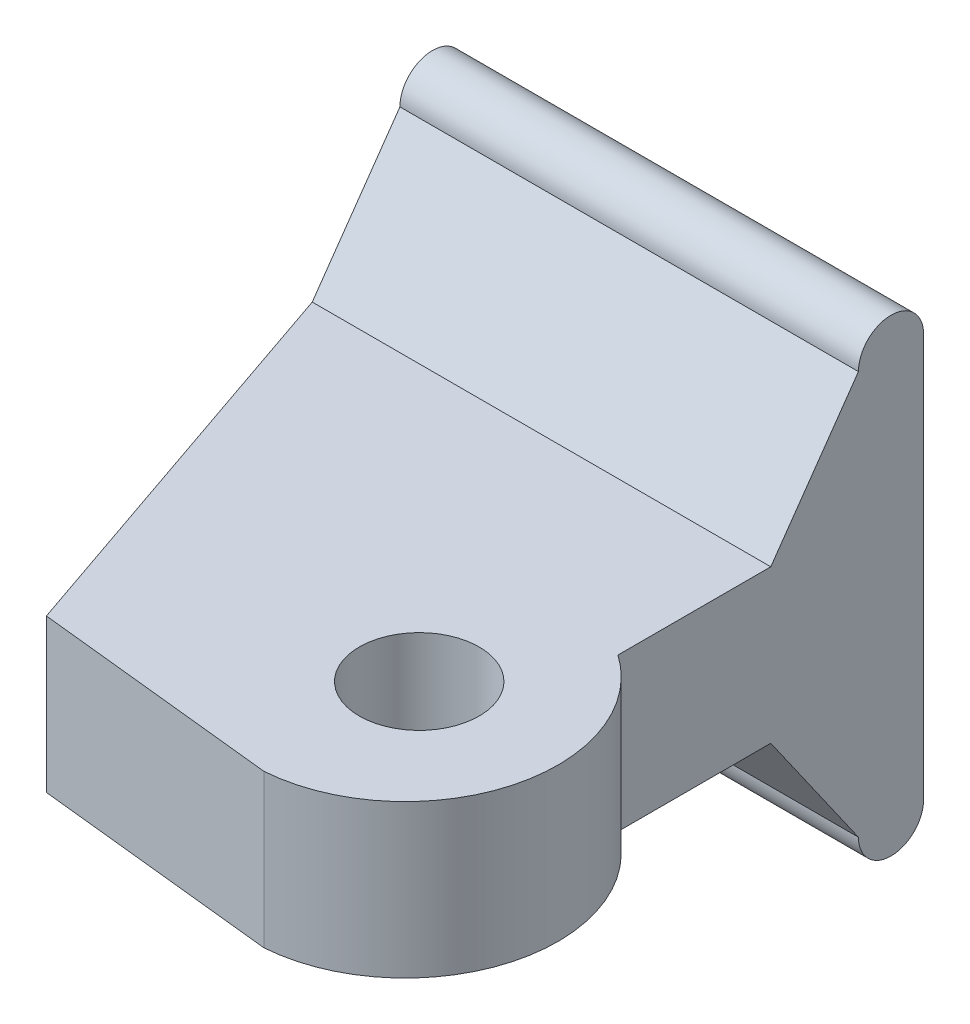
ISO-10303-21;
HEADER;
FILE_DESCRIPTION(('STEP AP214'),'2;1');
FILE_NAME('part.step','',(''),(''),'','','');
FILE_SCHEMA(('AUTOMOTIVE_DESIGN { 1 0 10303 214 1 1 1 1 }'));
ENDSEC;
DATA;
#1=APPLICATION_CONTEXT('core data for automotive mechanical design processes');
#2=APPLICATION_PROTOCOL_DEFINITION('international standard','automotive_design',2000,#1);
#3=PRODUCT_CONTEXT('',#1,'mechanical');
#4=PRODUCT('Part','Part','',(#3));
#5=PRODUCT_RELATED_PRODUCT_CATEGORY('part','',(#4));
#6=PRODUCT_DEFINITION_FORMATION('','',#4);
#7=PRODUCT_DEFINITION_CONTEXT('part definition',#1,'design');
#8=PRODUCT_DEFINITION('design','',#6,#7);
#9=PRODUCT_DEFINITION_SHAPE('','',#8);
#10=(LENGTH_UNIT() NAMED_UNIT(*) SI_UNIT(.MILLI.,.METRE.));
#11=(NAMED_UNIT(*) PLANE_ANGLE_UNIT() SI_UNIT($,.RADIAN.));
#12=(NAMED_UNIT(*) SI_UNIT($,.STERADIAN.) SOLID_ANGLE_UNIT());
#13=UNCERTAINTY_MEASURE_WITH_UNIT(LENGTH_MEASURE(1.E-05),#10,'distance_accuracy_value','');
#14=(GEOMETRIC_REPRESENTATION_CONTEXT(3) GLOBAL_UNCERTAINTY_ASSIGNED_CONTEXT((#13)) GLOBAL_UNIT_ASSIGNED_CONTEXT((#10,
#11,#12)) REPRESENTATION_CONTEXT('',''));
#15=CARTESIAN_POINT('',(0.,0.,0.));
#16=DIRECTION('',(0.,0.,1.));
#17=DIRECTION('',(1.,0.,0.));
#18=AXIS2_PLACEMENT_3D('',#15,#16,#17);
#19=CARTESIAN_POINT('',(9.06408672353238,6.35,11.5560190785289));
#20=DIRECTION('',(0.,1.,0.));
#21=DIRECTION('',(0.,0.,1.));
#22=AXIS2_PLACEMENT_3D('',#19,#20,#21);
#23=PLANE('',#22);
#24=CARTESIAN_POINT('',(9.06408672353238,6.35,11.5560190785289));
#25=DIRECTION('',(0.,1.,0.));
#26=DIRECTION('',(0.,0.,1.));
#27=AXIS2_PLACEMENT_3D('',#24,#25,#26);
#28=CIRCLE('',#27,6.35);
#29=CARTESIAN_POINT('',(9.52499999999998,6.35,17.889269346091));
#30=VERTEX_POINT('',#29);
#31=CARTESIAN_POINT('',(12.7,6.35,6.35000000000004));
#32=VERTEX_POINT('',#31);
#33=EDGE_CURVE('E173',#30,#32,#28,.T.);
#34=ORIENTED_EDGE('',*,*,#33,.T.);
#35=DIRECTION('',(0.,0.,-1.));
#36=VECTOR('',#35,1.);
#37=CARTESIAN_POINT('',(12.7,6.35,0.));
#38=LINE('',#37,#36);
#39=CARTESIAN_POINT('',(12.7,6.35,0.));
#40=VERTEX_POINT('',#39);
#41=EDGE_CURVE('E89',#32,#40,#38,.T.);
#42=ORIENTED_EDGE('',*,*,#41,.T.);
#43=DIRECTION('',(-1.,0.,0.));
#44=VECTOR('',#43,1.);
#45=CARTESIAN_POINT('',(-6.35,6.35,0.));
#46=LINE('',#45,#44);
#47=CARTESIAN_POINT('',(-6.35,6.35,0.));
#48=VERTEX_POINT('',#47);
#49=EDGE_CURVE('E135',#40,#48,#46,.T.);
#50=ORIENTED_EDGE('',*,*,#49,.T.);
#51=DIRECTION('',(0.324619143877709,0.,0.945844813607446));
#52=VECTOR('',#51,1.);
#53=CARTESIAN_POINT('',(-0.578271621854337,6.35,16.8171207859404));
#54=LINE('',#53,#52);
#55=CARTESIAN_POINT('',(-0.578271621854337,6.35,16.8171207859404));
#56=VERTEX_POINT('',#55);
#57=EDGE_CURVE('E142',#48,#56,#54,.T.);
#58=ORIENTED_EDGE('',*,*,#57,.T.);
#59=DIRECTION('',(0.994416498214008,0.,0.105526433085695));
#60=VECTOR('',#59,1.);
#61=CARTESIAN_POINT('',(9.52499999999998,6.35,17.889269346091));
#62=LINE('',#61,#60);
#63=EDGE_CURVE('E63',#56,#30,#62,.T.);
#64=ORIENTED_EDGE('',*,*,#63,.T.);
#65=EDGE_LOOP('',(#34,#42,#50,#58,#64));
#66=FACE_BOUND('',#65,.T.);
#67=CARTESIAN_POINT('',(9.52499999999998,6.35,11.4299999999999));
#68=DIRECTION('',(0.,1.,0.));
#69=DIRECTION('',(0.,0.,1.));
#70=AXIS2_PLACEMENT_3D('',#67,#68,#69);
#71=CIRCLE('',#70,2.4892);
#72=CARTESIAN_POINT('',(9.52499999999998,6.35,13.9191999999999));
#73=VERTEX_POINT('',#72);
#74=EDGE_CURVE('E160',#73,#73,#71,.T.);
#75=ORIENTED_EDGE('',*,*,#74,.F.);
#76=EDGE_LOOP('',(#75));
#77=FACE_BOUND('',#76,.T.);
#78=ADVANCED_FACE('F39',(#66,#77),#23,.T.);
#79=CARTESIAN_POINT('',(9.06408672353238,0.,11.5560190785289));
#80=DIRECTION('',(0.,1.,0.));
#81=DIRECTION('',(0.,0.,1.));
#82=AXIS2_PLACEMENT_3D('',#79,#80,#81);
#83=PLANE('',#82);
#84=CARTESIAN_POINT('',(9.06408672353238,0.,11.5560190785289));
#85=DIRECTION('',(0.,1.,0.));
#86=DIRECTION('',(0.,0.,1.));
#87=AXIS2_PLACEMENT_3D('',#84,#85,#86);
#88=CIRCLE('',#87,6.35);
#89=CARTESIAN_POINT('',(9.52499999999998,0.,17.889269346091));
#90=VERTEX_POINT('',#89);
#91=CARTESIAN_POINT('',(12.7,0.,6.35000000000004));
#92=VERTEX_POINT('',#91);
#93=EDGE_CURVE('E155',#90,#92,#88,.T.);
#94=ORIENTED_EDGE('',*,*,#93,.F.);
#95=DIRECTION('',(0.994416498214008,0.,0.105526433085695));
#96=VECTOR('',#95,1.);
#97=CARTESIAN_POINT('',(9.52499999999998,0.,17.889269346091));
#98=LINE('',#97,#96);
#99=CARTESIAN_POINT('',(-0.578271621854337,0.,16.8171207859404));
#100=VERTEX_POINT('',#99);
#101=EDGE_CURVE('E81',#100,#90,#98,.T.);
#102=ORIENTED_EDGE('',*,*,#101,.F.);
#103=DIRECTION('',(0.324619143877709,0.,0.945844813607446));
#104=VECTOR('',#103,1.);
#105=CARTESIAN_POINT('',(-0.578271621854337,0.,16.8171207859404));
#106=LINE('',#105,#104);
#107=CARTESIAN_POINT('',(-6.35,0.,0.));
#108=VERTEX_POINT('',#107);
#109=EDGE_CURVE('E168',#108,#100,#106,.T.);
#110=ORIENTED_EDGE('',*,*,#109,.F.);
#111=DIRECTION('',(-1.,0.,0.));
#112=VECTOR('',#111,1.);
#113=CARTESIAN_POINT('',(-6.35,0.,0.));
#114=LINE('',#113,#112);
#115=CARTESIAN_POINT('',(12.7,0.,0.));
#116=VERTEX_POINT('',#115);
#117=EDGE_CURVE('E164',#116,#108,#114,.T.);
#118=ORIENTED_EDGE('',*,*,#117,.F.);
#119=DIRECTION('',(0.,0.,-1.));
#120=VECTOR('',#119,1.);
#121=CARTESIAN_POINT('',(12.7,0.,0.));
#122=LINE('',#121,#120);
#123=EDGE_CURVE('E159',#92,#116,#122,.T.);
#124=ORIENTED_EDGE('',*,*,#123,.F.);
#125=EDGE_LOOP('',(#94,#102,#110,#118,#124));
#126=FACE_BOUND('',#125,.T.);
#127=CARTESIAN_POINT('',(9.52499999999998,0.,11.4299999999999));
#128=DIRECTION('',(0.,1.,0.));
#129=DIRECTION('',(0.,0.,1.));
#130=AXIS2_PLACEMENT_3D('',#127,#128,#129);
#131=CIRCLE('',#130,2.4892);
#132=CARTESIAN_POINT('',(9.52499999999998,0.,13.9191999999999));
#133=VERTEX_POINT('',#132);
#134=EDGE_CURVE('E214',#133,#133,#131,.T.);
#135=ORIENTED_EDGE('',*,*,#134,.T.);
#136=EDGE_LOOP('',(#135));
#137=FACE_BOUND('',#136,.T.);
#138=ADVANCED_FACE('F186',(#126,#137),#83,.F.);
#139=CARTESIAN_POINT('',(9.06408672353238,6.35,11.5560190785289));
#140=DIRECTION('',(0.,-1.,0.));
#141=DIRECTION('',(0.,0.,-1.));
#142=AXIS2_PLACEMENT_3D('',#139,#140,#141);
#143=CYLINDRICAL_SURFACE('',#142,6.35);
#144=ORIENTED_EDGE('',*,*,#93,.T.);
#145=DIRECTION('',(0.,-1.,0.));
#146=VECTOR('',#145,1.);
#147=CARTESIAN_POINT('',(12.7,6.35,6.35000000000004));
#148=LINE('',#147,#146);
#149=EDGE_CURVE('E48',#32,#92,#148,.T.);
#150=ORIENTED_EDGE('',*,*,#149,.F.);
#151=ORIENTED_EDGE('',*,*,#33,.F.);
#152=DIRECTION('',(0.,-1.,0.));
#153=VECTOR('',#152,1.);
#154=CARTESIAN_POINT('',(9.52499999999998,6.35,17.889269346091));
#155=LINE('',#154,#153);
#156=EDGE_CURVE('E151',#30,#90,#155,.T.);
#157=ORIENTED_EDGE('',*,*,#156,.T.);
#158=EDGE_LOOP('',(#144,#150,#151,#157));
#159=FACE_BOUND('',#158,.T.);
#160=ADVANCED_FACE('F41',(#159),#143,.T.);
#161=CARTESIAN_POINT('',(12.7,6.35,0.));
#162=DIRECTION('',(-1.,0.,0.));
#163=DIRECTION('',(0.,0.,1.));
#164=AXIS2_PLACEMENT_3D('',#161,#162,#163);
#165=PLANE('',#164);
#166=ORIENTED_EDGE('',*,*,#123,.T.);
#167=DIRECTION('',(0.,-0.819152044288995,-0.573576436351042));
#168=VECTOR('',#167,1.);
#169=CARTESIAN_POINT('',(12.7,-5.20161548123512,-3.64221037082912));
#170=LINE('',#169,#168);
#171=CARTESIAN_POINT('',(12.7,-5.20161548123512,-3.64221037082913));
#172=VERTEX_POINT('',#171);
#173=EDGE_CURVE('E138',#116,#172,#170,.T.);
#174=ORIENTED_EDGE('',*,*,#173,.T.);
#175=CARTESIAN_POINT('',(12.7,-5.20161548123509,-4.99610518541458));
#176=DIRECTION('',(1.,0.,0.));
#177=DIRECTION('',(0.,0.,-1.));
#178=AXIS2_PLACEMENT_3D('',#175,#176,#177);
#179=CIRCLE('',#178,1.35389481458544);
#180=CARTESIAN_POINT('',(12.7,-5.20161548123512,-6.35));
#181=VERTEX_POINT('',#180);
#182=EDGE_CURVE('E195',#172,#181,#179,.T.);
#183=ORIENTED_EDGE('',*,*,#182,.T.);
#184=DIRECTION('',(0.,1.,0.));
#185=VECTOR('',#184,1.);
#186=CARTESIAN_POINT('',(12.7,11.5516154812351,-6.35));
#187=LINE('',#186,#185);
#188=CARTESIAN_POINT('',(12.7,11.5516154812351,-6.34999999999998));
#189=VERTEX_POINT('',#188);
#190=EDGE_CURVE('E198',#181,#189,#187,.T.);
#191=ORIENTED_EDGE('',*,*,#190,.T.);
#192=CARTESIAN_POINT('',(12.7,11.5516154812351,-4.99610518541456));
#193=DIRECTION('',(1.,0.,0.));
#194=DIRECTION('',(0.,0.,-1.));
#195=AXIS2_PLACEMENT_3D('',#192,#193,#194);
#196=CIRCLE('',#195,1.35389481458543);
#197=CARTESIAN_POINT('',(12.7,11.5516154812351,-3.64221037082915));
#198=VERTEX_POINT('',#197);
#199=EDGE_CURVE('E205',#189,#198,#196,.T.);
#200=ORIENTED_EDGE('',*,*,#199,.T.);
#201=DIRECTION('',(0.,-0.819152044288987,0.573576436351053));
#202=VECTOR('',#201,1.);
#203=CARTESIAN_POINT('',(12.7,6.35,0.));
#204=LINE('',#203,#202);
#205=EDGE_CURVE('E209',#198,#40,#204,.T.);
#206=ORIENTED_EDGE('',*,*,#205,.T.);
#207=ORIENTED_EDGE('',*,*,#41,.F.);
#208=ORIENTED_EDGE('',*,*,#149,.T.);
#209=EDGE_LOOP('',(#166,#174,#183,#191,#200,#206,#207,#208));
#210=FACE_BOUND('',#209,.T.);
#211=ADVANCED_FACE('F179',(#210),#165,.F.);
#212=CARTESIAN_POINT('',(-0.578271621854337,6.35,16.8171207859404));
#213=DIRECTION('',(0.945844813607445,0.,-0.324619143877709));
#214=DIRECTION('',(-0.324619143877709,0.,-0.945844813607446));
#215=AXIS2_PLACEMENT_3D('',#212,#213,#214);
#216=PLANE('',#215);
#217=ORIENTED_EDGE('',*,*,#57,.F.);
#218=DIRECTION('',(0.,-1.,0.));
#219=VECTOR('',#218,1.);
#220=CARTESIAN_POINT('',(-6.35,12.9055102958205,0.));
#221=LINE('',#220,#219);
#222=EDGE_CURVE('E118',#48,#108,#221,.T.);
#223=ORIENTED_EDGE('',*,*,#222,.T.);
#224=ORIENTED_EDGE('',*,*,#109,.T.);
#225=DIRECTION('',(0.,-1.,0.));
#226=VECTOR('',#225,1.);
#227=CARTESIAN_POINT('',(-0.578271621854337,6.35,16.8171207859404));
#228=LINE('',#227,#226);
#229=EDGE_CURVE('E147',#56,#100,#228,.T.);
#230=ORIENTED_EDGE('',*,*,#229,.F.);
#231=EDGE_LOOP('',(#217,#223,#224,#230));
#232=FACE_BOUND('',#231,.T.);
#233=ADVANCED_FACE('F146',(#232),#216,.F.);
#234=CARTESIAN_POINT('',(9.52499999999998,6.35,17.889269346091));
#235=DIRECTION('',(0.105526433085695,0.,-0.994416498214008));
#236=DIRECTION('',(-0.994416498214008,0.,-0.105526433085695));
#237=AXIS2_PLACEMENT_3D('',#234,#235,#236);
#238=PLANE('',#237);
#239=ORIENTED_EDGE('',*,*,#101,.T.);
#240=ORIENTED_EDGE('',*,*,#156,.F.);
#241=ORIENTED_EDGE('',*,*,#63,.F.);
#242=ORIENTED_EDGE('',*,*,#229,.T.);
#243=EDGE_LOOP('',(#239,#240,#241,#242));
#244=FACE_BOUND('',#243,.T.);
#245=ADVANCED_FACE('F235',(#244),#238,.F.);
#246=CARTESIAN_POINT('',(9.52499999999998,6.35,11.4299999999999));
#247=DIRECTION('',(0.,-1.,0.));
#248=DIRECTION('',(0.,0.,-1.));
#249=AXIS2_PLACEMENT_3D('',#246,#247,#248);
#250=CYLINDRICAL_SURFACE('',#249,2.4892);
#251=ORIENTED_EDGE('',*,*,#74,.T.);
#252=EDGE_LOOP('',(#251));
#253=FACE_BOUND('',#252,.T.);
#254=ORIENTED_EDGE('',*,*,#134,.F.);
#255=EDGE_LOOP('',(#254));
#256=FACE_BOUND('',#255,.T.);
#257=ADVANCED_FACE('F233',(#253,#256),#250,.F.);
#258=CARTESIAN_POINT('',(-28.4965186692293,6.35,0.));
#259=DIRECTION('',(0.,0.573576436351053,0.819152044288987));
#260=DIRECTION('',(0.,-0.819152044288987,0.573576436351053));
#261=AXIS2_PLACEMENT_3D('',#258,#259,#260);
#262=PLANE('',#261);
#263=DIRECTION('',(0.,0.819152044288987,-0.573576436351053));
#264=VECTOR('',#263,1.);
#265=CARTESIAN_POINT('',(-6.35,6.35,0.));
#266=LINE('',#265,#264);
#267=CARTESIAN_POINT('',(-6.35,11.5516154812351,-3.64221037082913));
#268=VERTEX_POINT('',#267);
#269=EDGE_CURVE('E121',#48,#268,#266,.T.);
#270=ORIENTED_EDGE('',*,*,#269,.F.);
#271=ORIENTED_EDGE('',*,*,#49,.F.);
#272=ORIENTED_EDGE('',*,*,#205,.F.);
#273=DIRECTION('',(1.,0.,0.));
#274=VECTOR('',#273,1.);
#275=CARTESIAN_POINT('',(-28.4965186692293,11.5516154812351,-3.64221037082915));
#276=LINE('',#275,#274);
#277=EDGE_CURVE('E136',#268,#198,#276,.T.);
#278=ORIENTED_EDGE('',*,*,#277,.F.);
#279=EDGE_LOOP('',(#270,#271,#272,#278));
#280=FACE_BOUND('',#279,.T.);
#281=ADVANCED_FACE('F133',(#280),#262,.T.);
#282=CARTESIAN_POINT('',(-28.4965186692293,11.5516154812351,-4.99610518541456));
#283=DIRECTION('',(1.,0.,0.));
#284=DIRECTION('',(0.,0.,-1.));
#285=AXIS2_PLACEMENT_3D('',#282,#283,#284);
#286=CYLINDRICAL_SURFACE('',#285,1.35389481458543);
#287=CARTESIAN_POINT('',(-6.35,11.5516154812351,-4.99610518541456));
#288=DIRECTION('',(1.,0.,0.));
#289=DIRECTION('',(0.,0.,-1.));
#290=AXIS2_PLACEMENT_3D('',#287,#288,#289);
#291=CIRCLE('',#290,1.35389481458543);
#292=CARTESIAN_POINT('',(-6.35,11.5516154812351,-6.35));
#293=VERTEX_POINT('',#292);
#294=EDGE_CURVE('E139',#268,#293,#291,.F.);
#295=ORIENTED_EDGE('',*,*,#294,.F.);
#296=ORIENTED_EDGE('',*,*,#277,.T.);
#297=ORIENTED_EDGE('',*,*,#199,.F.);
#298=DIRECTION('',(1.,0.,0.));
#299=VECTOR('',#298,1.);
#300=CARTESIAN_POINT('',(-28.4965186692293,11.5516154812351,-6.34999999999998));
#301=LINE('',#300,#299);
#302=EDGE_CURVE('E215',#293,#189,#301,.T.);
#303=ORIENTED_EDGE('',*,*,#302,.F.);
#304=EDGE_LOOP('',(#295,#296,#297,#303));
#305=FACE_BOUND('',#304,.T.);
#306=ADVANCED_FACE('F242',(#305),#286,.T.);
#307=CARTESIAN_POINT('',(-28.4965186692293,11.5516154812351,-6.35));
#308=DIRECTION('',(0.,0.,-1.));
#309=DIRECTION('',(0.,1.,0.));
#310=AXIS2_PLACEMENT_3D('',#307,#308,#309);
#311=PLANE('',#310);
#312=DIRECTION('',(0.,-1.,0.));
#313=VECTOR('',#312,1.);
#314=CARTESIAN_POINT('',(-6.35,12.9055102958205,-6.35));
#315=LINE('',#314,#313);
#316=CARTESIAN_POINT('',(-6.35,-5.20161548123509,-6.35));
#317=VERTEX_POINT('',#316);
#318=EDGE_CURVE('E127',#293,#317,#315,.T.);
#319=ORIENTED_EDGE('',*,*,#318,.F.);
#320=ORIENTED_EDGE('',*,*,#302,.T.);
#321=ORIENTED_EDGE('',*,*,#190,.F.);
#322=DIRECTION('',(1.,0.,0.));
#323=VECTOR('',#322,1.);
#324=CARTESIAN_POINT('',(-28.4965186692293,-5.20161548123512,-6.35));
#325=LINE('',#324,#323);
#326=EDGE_CURVE('E218',#317,#181,#325,.T.);
#327=ORIENTED_EDGE('',*,*,#326,.F.);
#328=EDGE_LOOP('',(#319,#320,#321,#327));
#329=FACE_BOUND('',#328,.T.);
#330=ADVANCED_FACE('F290',(#329),#311,.T.);
#331=CARTESIAN_POINT('',(-28.4965186692293,-5.20161548123509,-4.99610518541458));
#332=DIRECTION('',(1.,0.,0.));
#333=DIRECTION('',(0.,0.,-1.));
#334=AXIS2_PLACEMENT_3D('',#331,#332,#333);
#335=CYLINDRICAL_SURFACE('',#334,1.35389481458544);
#336=CARTESIAN_POINT('',(-6.35,-5.20161548123509,-4.99610518541458));
#337=DIRECTION('',(1.,0.,0.));
#338=DIRECTION('',(0.,0.,-1.));
#339=AXIS2_PLACEMENT_3D('',#336,#337,#338);
#340=CIRCLE('',#339,1.35389481458544);
#341=CARTESIAN_POINT('',(-6.35,-5.20161548123512,-3.64221037082913));
#342=VERTEX_POINT('',#341);
#343=EDGE_CURVE('E54',#317,#342,#340,.F.);
#344=ORIENTED_EDGE('',*,*,#343,.F.);
#345=ORIENTED_EDGE('',*,*,#326,.T.);
#346=ORIENTED_EDGE('',*,*,#182,.F.);
#347=DIRECTION('',(1.,0.,0.));
#348=VECTOR('',#347,1.);
#349=CARTESIAN_POINT('',(-28.4965186692293,-5.20161548123512,-3.64221037082913));
#350=LINE('',#349,#348);
#351=EDGE_CURVE('E191',#342,#172,#350,.T.);
#352=ORIENTED_EDGE('',*,*,#351,.F.);
#353=EDGE_LOOP('',(#344,#345,#346,#352));
#354=FACE_BOUND('',#353,.T.);
#355=ADVANCED_FACE('F300',(#354),#335,.T.);
#356=CARTESIAN_POINT('',(-28.4965186692293,-5.20161548123512,-3.64221037082912));
#357=DIRECTION('',(0.,-0.573576436351042,0.819152044288995));
#358=DIRECTION('',(0.,-0.819152044288995,-0.573576436351042));
#359=AXIS2_PLACEMENT_3D('',#356,#357,#358);
#360=PLANE('',#359);
#361=DIRECTION('',(0.,0.819152044288995,0.573576436351042));
#362=VECTOR('',#361,1.);
#363=CARTESIAN_POINT('',(-6.35,-5.20161548123512,-3.64221037082912));
#364=LINE('',#363,#362);
#365=EDGE_CURVE('E11',#342,#108,#364,.T.);
#366=ORIENTED_EDGE('',*,*,#365,.F.);
#367=ORIENTED_EDGE('',*,*,#351,.T.);
#368=ORIENTED_EDGE('',*,*,#173,.F.);
#369=ORIENTED_EDGE('',*,*,#117,.T.);
#370=EDGE_LOOP('',(#366,#367,#368,#369));
#371=FACE_BOUND('',#370,.T.);
#372=ADVANCED_FACE('F189',(#371),#360,.T.);
#373=CARTESIAN_POINT('',(-6.35,12.9055102958205,0.));
#374=DIRECTION('',(1.,0.,0.));
#375=DIRECTION('',(0.,0.,-1.));
#376=AXIS2_PLACEMENT_3D('',#373,#374,#375);
#377=PLANE('',#376);
#378=ORIENTED_EDGE('',*,*,#269,.T.);
#379=ORIENTED_EDGE('',*,*,#294,.T.);
#380=ORIENTED_EDGE('',*,*,#318,.T.);
#381=ORIENTED_EDGE('',*,*,#343,.T.);
#382=ORIENTED_EDGE('',*,*,#365,.T.);
#383=ORIENTED_EDGE('',*,*,#222,.F.);
#384=EDGE_LOOP('',(#378,#379,#380,#381,#382,#383));
#385=FACE_BOUND('',#384,.T.);
#386=ADVANCED_FACE('F120',(#385),#377,.F.);
#387=CLOSED_SHELL('',(#78,#138,#160,#211,#233,#245,#257,#281,#306,#330,#355,#372,#386));
#388=MANIFOLD_SOLID_BREP('B2',#387);
#389=ADVANCED_BREP_SHAPE_REPRESENTATION('',(#18,#388),#14);
#390=SHAPE_DEFINITION_REPRESENTATION(#9,#389);
ENDSEC;
END-ISO-10303-21;
